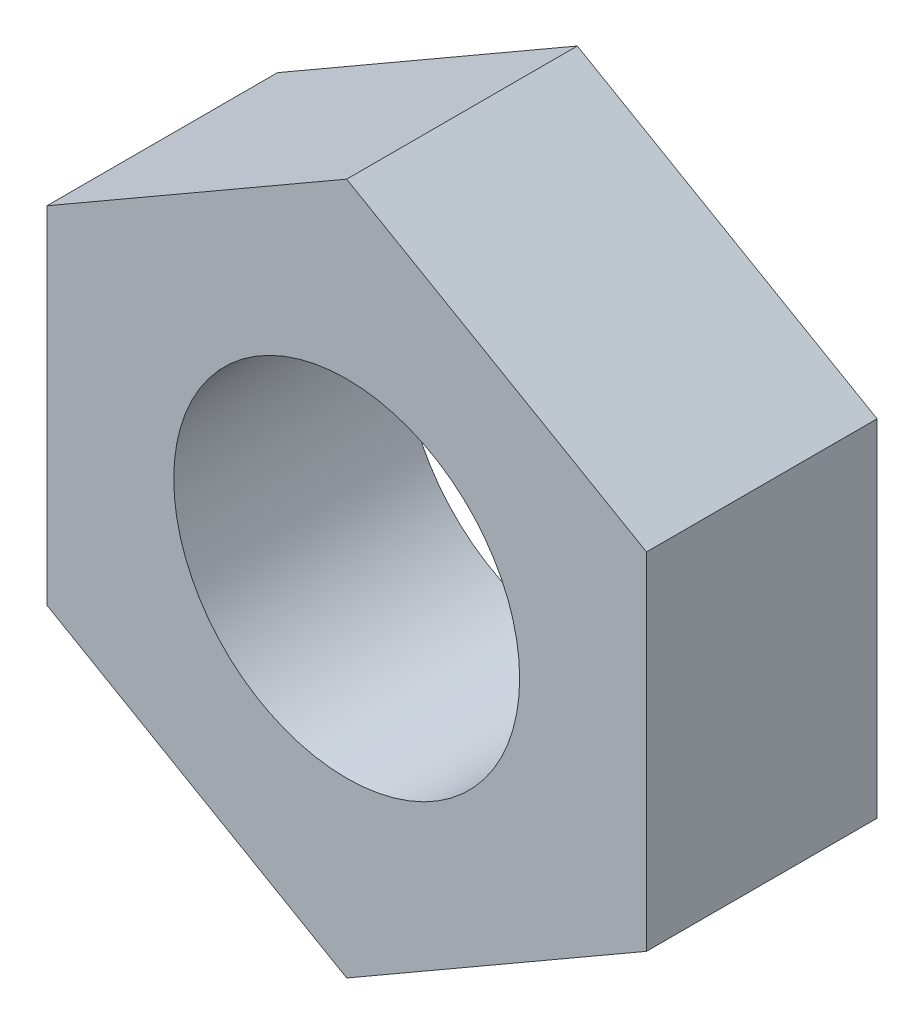
ISO-10303-21;
HEADER;
FILE_DESCRIPTION(('STEP AP214'),'2;1');
FILE_NAME('part.step','',(''),(''),'','','');
FILE_SCHEMA(('AUTOMOTIVE_DESIGN { 1 0 10303 214 1 1 1 1 }'));
ENDSEC;
DATA;
#1=APPLICATION_CONTEXT('core data for automotive mechanical design processes');
#2=APPLICATION_PROTOCOL_DEFINITION('international standard','automotive_design',2000,#1);
#3=PRODUCT_CONTEXT('',#1,'mechanical');
#4=PRODUCT('Part','Part','',(#3));
#5=PRODUCT_RELATED_PRODUCT_CATEGORY('part','',(#4));
#6=PRODUCT_DEFINITION_FORMATION('','',#4);
#7=PRODUCT_DEFINITION_CONTEXT('part definition',#1,'design');
#8=PRODUCT_DEFINITION('design','',#6,#7);
#9=PRODUCT_DEFINITION_SHAPE('','',#8);
#10=(LENGTH_UNIT() NAMED_UNIT(*) SI_UNIT(.MILLI.,.METRE.));
#11=(NAMED_UNIT(*) PLANE_ANGLE_UNIT() SI_UNIT($,.RADIAN.));
#12=(NAMED_UNIT(*) SI_UNIT($,.STERADIAN.) SOLID_ANGLE_UNIT());
#13=UNCERTAINTY_MEASURE_WITH_UNIT(LENGTH_MEASURE(1.E-05),#10,'distance_accuracy_value','');
#14=(GEOMETRIC_REPRESENTATION_CONTEXT(3) GLOBAL_UNCERTAINTY_ASSIGNED_CONTEXT((#13)) GLOBAL_UNIT_ASSIGNED_CONTEXT((#10,
#11,#12)) REPRESENTATION_CONTEXT('',''));
#15=CARTESIAN_POINT('',(0.,0.,0.));
#16=DIRECTION('',(0.,0.,1.));
#17=DIRECTION('',(1.,0.,0.));
#18=AXIS2_PLACEMENT_3D('',#15,#16,#17);
#19=CARTESIAN_POINT('',(0.,0.,4.));
#20=DIRECTION('',(0.,0.,-1.));
#21=DIRECTION('',(-1.,0.,0.));
#22=AXIS2_PLACEMENT_3D('',#19,#20,#21);
#23=PLANE('',#22);
#24=DIRECTION('',(0.866185586048601,-0.499722453489577,0.));
#25=VECTOR('',#24,1.);
#26=CARTESIAN_POINT('',(0.,0.,4.));
#27=LINE('',#26,#25);
#28=CARTESIAN_POINT('',(-5.2,3.,4.));
#29=VERTEX_POINT('',#28);
#30=CARTESIAN_POINT('',(0.,0.,4.));
#31=VERTEX_POINT('',#30);
#32=EDGE_CURVE('E133',#29,#31,#27,.T.);
#33=ORIENTED_EDGE('',*,*,#32,.T.);
#34=DIRECTION('',(0.8661855860486,0.499722453489577,0.));
#35=VECTOR('',#34,1.);
#36=CARTESIAN_POINT('',(5.2,3.,4.));
#37=LINE('',#36,#35);
#38=CARTESIAN_POINT('',(5.2,3.,4.));
#39=VERTEX_POINT('',#38);
#40=EDGE_CURVE('E91',#31,#39,#37,.T.);
#41=ORIENTED_EDGE('',*,*,#40,.T.);
#42=DIRECTION('',(0.,1.,0.));
#43=VECTOR('',#42,1.);
#44=CARTESIAN_POINT('',(5.2,3.,4.));
#45=LINE('',#44,#43);
#46=CARTESIAN_POINT('',(5.2,9.,4.));
#47=VERTEX_POINT('',#46);
#48=EDGE_CURVE('E104',#39,#47,#45,.T.);
#49=ORIENTED_EDGE('',*,*,#48,.T.);
#50=DIRECTION('',(-0.8661855860486,0.499722453489577,0.));
#51=VECTOR('',#50,1.);
#52=CARTESIAN_POINT('',(0.,12.,4.));
#53=LINE('',#52,#51);
#54=CARTESIAN_POINT('',(0.,12.,4.));
#55=VERTEX_POINT('',#54);
#56=EDGE_CURVE('E98',#47,#55,#53,.T.);
#57=ORIENTED_EDGE('',*,*,#56,.T.);
#58=DIRECTION('',(-0.8661855860486,-0.499722453489577,0.));
#59=VECTOR('',#58,1.);
#60=CARTESIAN_POINT('',(-5.2,9.,4.));
#61=LINE('',#60,#59);
#62=CARTESIAN_POINT('',(-5.2,9.,4.));
#63=VERTEX_POINT('',#62);
#64=EDGE_CURVE('E102',#55,#63,#61,.T.);
#65=ORIENTED_EDGE('',*,*,#64,.T.);
#66=DIRECTION('',(0.,-1.,0.));
#67=VECTOR('',#66,1.);
#68=CARTESIAN_POINT('',(-5.2,3.,4.));
#69=LINE('',#68,#67);
#70=EDGE_CURVE('E54',#63,#29,#69,.T.);
#71=ORIENTED_EDGE('',*,*,#70,.T.);
#72=EDGE_LOOP('',(#33,#41,#49,#57,#65,#71));
#73=FACE_BOUND('',#72,.T.);
#74=CARTESIAN_POINT('',(0.,6.,4.));
#75=DIRECTION('',(0.,0.,1.));
#76=DIRECTION('',(1.,0.,0.));
#77=AXIS2_PLACEMENT_3D('',#74,#75,#76);
#78=CIRCLE('',#77,3.);
#79=CARTESIAN_POINT('',(3.,6.,4.));
#80=VERTEX_POINT('',#79);
#81=EDGE_CURVE('E126',#80,#80,#78,.T.);
#82=ORIENTED_EDGE('',*,*,#81,.F.);
#83=EDGE_LOOP('',(#82));
#84=FACE_BOUND('',#83,.T.);
#85=ADVANCED_FACE('F37',(#73,#84),#23,.F.);
#86=CARTESIAN_POINT('',(0.,0.,0.));
#87=DIRECTION('',(0.,0.,-1.));
#88=DIRECTION('',(-1.,0.,0.));
#89=AXIS2_PLACEMENT_3D('',#86,#87,#88);
#90=PLANE('',#89);
#91=DIRECTION('',(0.866185586048601,-0.499722453489577,0.));
#92=VECTOR('',#91,1.);
#93=CARTESIAN_POINT('',(0.,0.,0.));
#94=LINE('',#93,#92);
#95=CARTESIAN_POINT('',(-5.2,3.,0.));
#96=VERTEX_POINT('',#95);
#97=CARTESIAN_POINT('',(0.,0.,0.));
#98=VERTEX_POINT('',#97);
#99=EDGE_CURVE('E122',#96,#98,#94,.T.);
#100=ORIENTED_EDGE('',*,*,#99,.F.);
#101=DIRECTION('',(0.,-1.,0.));
#102=VECTOR('',#101,1.);
#103=CARTESIAN_POINT('',(-5.2,3.,0.));
#104=LINE('',#103,#102);
#105=CARTESIAN_POINT('',(-5.2,9.,0.));
#106=VERTEX_POINT('',#105);
#107=EDGE_CURVE('E83',#106,#96,#104,.T.);
#108=ORIENTED_EDGE('',*,*,#107,.F.);
#109=DIRECTION('',(-0.8661855860486,-0.499722453489577,0.));
#110=VECTOR('',#109,1.);
#111=CARTESIAN_POINT('',(-5.2,9.,0.));
#112=LINE('',#111,#110);
#113=CARTESIAN_POINT('',(0.,12.,0.));
#114=VERTEX_POINT('',#113);
#115=EDGE_CURVE('E77',#114,#106,#112,.T.);
#116=ORIENTED_EDGE('',*,*,#115,.F.);
#117=DIRECTION('',(-0.8661855860486,0.499722453489577,0.));
#118=VECTOR('',#117,1.);
#119=CARTESIAN_POINT('',(0.,12.,0.));
#120=LINE('',#119,#118);
#121=CARTESIAN_POINT('',(5.2,9.,0.));
#122=VERTEX_POINT('',#121);
#123=EDGE_CURVE('E112',#122,#114,#120,.T.);
#124=ORIENTED_EDGE('',*,*,#123,.F.);
#125=DIRECTION('',(0.,1.,0.));
#126=VECTOR('',#125,1.);
#127=CARTESIAN_POINT('',(5.2,3.,0.));
#128=LINE('',#127,#126);
#129=CARTESIAN_POINT('',(5.2,3.,0.));
#130=VERTEX_POINT('',#129);
#131=EDGE_CURVE('E128',#130,#122,#128,.T.);
#132=ORIENTED_EDGE('',*,*,#131,.F.);
#133=DIRECTION('',(0.8661855860486,0.499722453489577,0.));
#134=VECTOR('',#133,1.);
#135=CARTESIAN_POINT('',(5.2,3.,0.));
#136=LINE('',#135,#134);
#137=EDGE_CURVE('E125',#98,#130,#136,.T.);
#138=ORIENTED_EDGE('',*,*,#137,.F.);
#139=EDGE_LOOP('',(#100,#108,#116,#124,#132,#138));
#140=FACE_BOUND('',#139,.T.);
#141=CARTESIAN_POINT('',(0.,6.,0.));
#142=DIRECTION('',(0.,0.,1.));
#143=DIRECTION('',(1.,0.,0.));
#144=AXIS2_PLACEMENT_3D('',#141,#142,#143);
#145=CIRCLE('',#144,3.);
#146=CARTESIAN_POINT('',(3.,6.,0.));
#147=VERTEX_POINT('',#146);
#148=EDGE_CURVE('E226',#147,#147,#145,.T.);
#149=ORIENTED_EDGE('',*,*,#148,.T.);
#150=EDGE_LOOP('',(#149));
#151=FACE_BOUND('',#150,.T.);
#152=ADVANCED_FACE('F142',(#140,#151),#90,.T.);
#153=CARTESIAN_POINT('',(0.,0.,4.));
#154=DIRECTION('',(0.499722453489577,0.866185586048601,0.));
#155=DIRECTION('',(-0.866185586048601,0.499722453489577,0.));
#156=AXIS2_PLACEMENT_3D('',#153,#154,#155);
#157=PLANE('',#156);
#158=ORIENTED_EDGE('',*,*,#99,.T.);
#159=DIRECTION('',(0.,0.,-1.));
#160=VECTOR('',#159,1.);
#161=CARTESIAN_POINT('',(0.,0.,4.));
#162=LINE('',#161,#160);
#163=EDGE_CURVE('E11',#31,#98,#162,.T.);
#164=ORIENTED_EDGE('',*,*,#163,.F.);
#165=ORIENTED_EDGE('',*,*,#32,.F.);
#166=DIRECTION('',(0.,0.,-1.));
#167=VECTOR('',#166,1.);
#168=CARTESIAN_POINT('',(-5.2,3.,4.));
#169=LINE('',#168,#167);
#170=EDGE_CURVE('E118',#29,#96,#169,.T.);
#171=ORIENTED_EDGE('',*,*,#170,.T.);
#172=EDGE_LOOP('',(#158,#164,#165,#171));
#173=FACE_BOUND('',#172,.T.);
#174=ADVANCED_FACE('F39',(#173),#157,.F.);
#175=CARTESIAN_POINT('',(5.2,3.,4.));
#176=DIRECTION('',(-0.499722453489577,0.8661855860486,0.));
#177=DIRECTION('',(-0.8661855860486,-0.499722453489577,0.));
#178=AXIS2_PLACEMENT_3D('',#175,#176,#177);
#179=PLANE('',#178);
#180=ORIENTED_EDGE('',*,*,#137,.T.);
#181=DIRECTION('',(0.,0.,-1.));
#182=VECTOR('',#181,1.);
#183=CARTESIAN_POINT('',(5.2,3.,4.));
#184=LINE('',#183,#182);
#185=EDGE_CURVE('E46',#39,#130,#184,.T.);
#186=ORIENTED_EDGE('',*,*,#185,.F.);
#187=ORIENTED_EDGE('',*,*,#40,.F.);
#188=ORIENTED_EDGE('',*,*,#163,.T.);
#189=EDGE_LOOP('',(#180,#186,#187,#188));
#190=FACE_BOUND('',#189,.T.);
#191=ADVANCED_FACE('F167',(#190),#179,.F.);
#192=CARTESIAN_POINT('',(5.2,3.,4.));
#193=DIRECTION('',(-1.,0.,0.));
#194=DIRECTION('',(0.,-1.,0.));
#195=AXIS2_PLACEMENT_3D('',#192,#193,#194);
#196=PLANE('',#195);
#197=ORIENTED_EDGE('',*,*,#131,.T.);
#198=DIRECTION('',(0.,0.,-1.));
#199=VECTOR('',#198,1.);
#200=CARTESIAN_POINT('',(5.2,9.,4.));
#201=LINE('',#200,#199);
#202=EDGE_CURVE('E113',#47,#122,#201,.T.);
#203=ORIENTED_EDGE('',*,*,#202,.F.);
#204=ORIENTED_EDGE('',*,*,#48,.F.);
#205=ORIENTED_EDGE('',*,*,#185,.T.);
#206=EDGE_LOOP('',(#197,#203,#204,#205));
#207=FACE_BOUND('',#206,.T.);
#208=ADVANCED_FACE('F139',(#207),#196,.F.);
#209=CARTESIAN_POINT('',(0.,12.,4.));
#210=DIRECTION('',(-0.499722453489577,-0.866185586048601,0.));
#211=DIRECTION('',(0.8661855860486,-0.499722453489577,0.));
#212=AXIS2_PLACEMENT_3D('',#209,#210,#211);
#213=PLANE('',#212);
#214=ORIENTED_EDGE('',*,*,#123,.T.);
#215=DIRECTION('',(0.,0.,-1.));
#216=VECTOR('',#215,1.);
#217=CARTESIAN_POINT('',(0.,12.,4.));
#218=LINE('',#217,#216);
#219=EDGE_CURVE('E109',#55,#114,#218,.T.);
#220=ORIENTED_EDGE('',*,*,#219,.F.);
#221=ORIENTED_EDGE('',*,*,#56,.F.);
#222=ORIENTED_EDGE('',*,*,#202,.T.);
#223=EDGE_LOOP('',(#214,#220,#221,#222));
#224=FACE_BOUND('',#223,.T.);
#225=ADVANCED_FACE('F110',(#224),#213,.F.);
#226=CARTESIAN_POINT('',(-5.2,9.,4.));
#227=DIRECTION('',(0.499722453489577,-0.8661855860486,0.));
#228=DIRECTION('',(0.8661855860486,0.499722453489577,0.));
#229=AXIS2_PLACEMENT_3D('',#226,#227,#228);
#230=PLANE('',#229);
#231=ORIENTED_EDGE('',*,*,#115,.T.);
#232=DIRECTION('',(0.,0.,-1.));
#233=VECTOR('',#232,1.);
#234=CARTESIAN_POINT('',(-5.2,9.,4.));
#235=LINE('',#234,#233);
#236=EDGE_CURVE('E114',#63,#106,#235,.T.);
#237=ORIENTED_EDGE('',*,*,#236,.F.);
#238=ORIENTED_EDGE('',*,*,#64,.F.);
#239=ORIENTED_EDGE('',*,*,#219,.T.);
#240=EDGE_LOOP('',(#231,#237,#238,#239));
#241=FACE_BOUND('',#240,.T.);
#242=ADVANCED_FACE('F116',(#241),#230,.F.);
#243=CARTESIAN_POINT('',(-5.2,3.,4.));
#244=DIRECTION('',(1.,0.,0.));
#245=DIRECTION('',(0.,1.,0.));
#246=AXIS2_PLACEMENT_3D('',#243,#244,#245);
#247=PLANE('',#246);
#248=ORIENTED_EDGE('',*,*,#107,.T.);
#249=ORIENTED_EDGE('',*,*,#170,.F.);
#250=ORIENTED_EDGE('',*,*,#70,.F.);
#251=ORIENTED_EDGE('',*,*,#236,.T.);
#252=EDGE_LOOP('',(#248,#249,#250,#251));
#253=FACE_BOUND('',#252,.T.);
#254=ADVANCED_FACE('F147',(#253),#247,.F.);
#255=CARTESIAN_POINT('',(0.,6.,4.));
#256=DIRECTION('',(0.,0.,-1.));
#257=DIRECTION('',(-1.,0.,0.));
#258=AXIS2_PLACEMENT_3D('',#255,#256,#257);
#259=CYLINDRICAL_SURFACE('',#258,3.);
#260=ORIENTED_EDGE('',*,*,#81,.T.);
#261=EDGE_LOOP('',(#260));
#262=FACE_BOUND('',#261,.T.);
#263=ORIENTED_EDGE('',*,*,#148,.F.);
#264=EDGE_LOOP('',(#263));
#265=FACE_BOUND('',#264,.T.);
#266=ADVANCED_FACE('F149',(#262,#265),#259,.F.);
#267=CLOSED_SHELL('',(#85,#152,#174,#191,#208,#225,#242,#254,#266));
#268=MANIFOLD_SOLID_BREP('B2',#267);
#269=ADVANCED_BREP_SHAPE_REPRESENTATION('',(#18,#268),#14);
#270=SHAPE_DEFINITION_REPRESENTATION(#9,#269);
ENDSEC;
END-ISO-10303-21;
